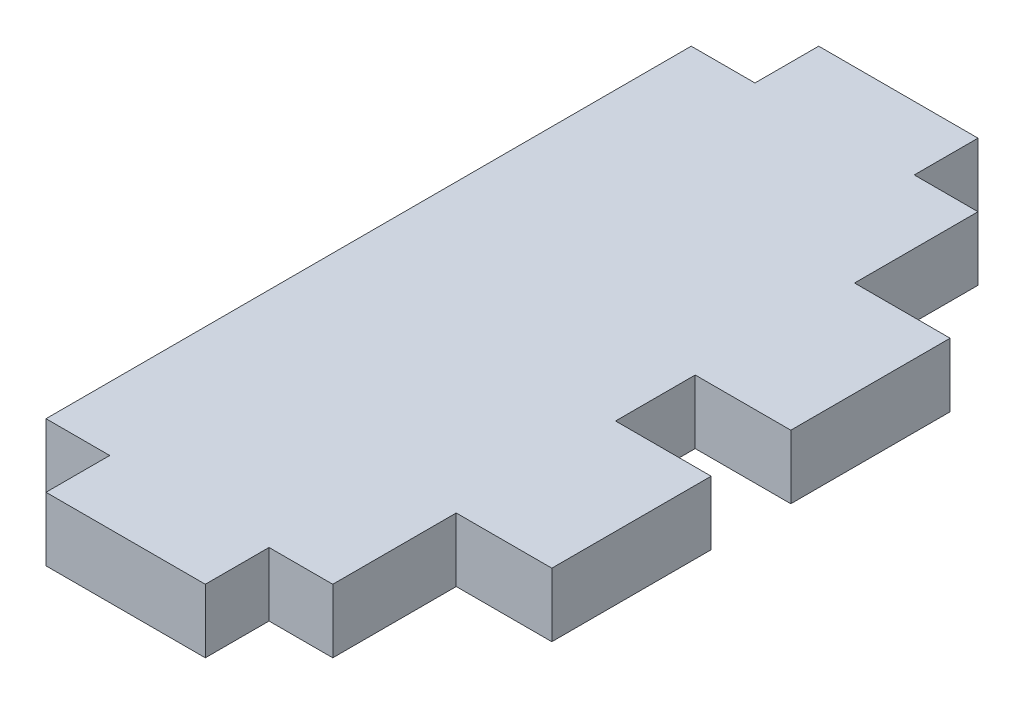
ISO-10303-21;
HEADER;
FILE_DESCRIPTION(('STEP AP214'),'2;1');
FILE_NAME('part.step','',(''),(''),'','','');
FILE_SCHEMA(('AUTOMOTIVE_DESIGN { 1 0 10303 214 1 1 1 1 }'));
ENDSEC;
DATA;
#1=APPLICATION_CONTEXT('core data for automotive mechanical design processes');
#2=APPLICATION_PROTOCOL_DEFINITION('international standard','automotive_design',2000,#1);
#3=PRODUCT_CONTEXT('',#1,'mechanical');
#4=PRODUCT('Part','Part','',(#3));
#5=PRODUCT_RELATED_PRODUCT_CATEGORY('part','',(#4));
#6=PRODUCT_DEFINITION_FORMATION('','',#4);
#7=PRODUCT_DEFINITION_CONTEXT('part definition',#1,'design');
#8=PRODUCT_DEFINITION('design','',#6,#7);
#9=PRODUCT_DEFINITION_SHAPE('','',#8);
#10=(LENGTH_UNIT() NAMED_UNIT(*) SI_UNIT(.MILLI.,.METRE.));
#11=(NAMED_UNIT(*) PLANE_ANGLE_UNIT() SI_UNIT($,.RADIAN.));
#12=(NAMED_UNIT(*) SI_UNIT($,.STERADIAN.) SOLID_ANGLE_UNIT());
#13=UNCERTAINTY_MEASURE_WITH_UNIT(LENGTH_MEASURE(1.E-05),#10,'distance_accuracy_value','');
#14=(GEOMETRIC_REPRESENTATION_CONTEXT(3) GLOBAL_UNCERTAINTY_ASSIGNED_CONTEXT((#13)) GLOBAL_UNIT_ASSIGNED_CONTEXT((#10,
#11,#12)) REPRESENTATION_CONTEXT('',''));
#15=CARTESIAN_POINT('',(0.,0.,0.));
#16=DIRECTION('',(0.,0.,1.));
#17=DIRECTION('',(1.,0.,0.));
#18=AXIS2_PLACEMENT_3D('',#15,#16,#17);
#19=CARTESIAN_POINT('',(18.,4.,0.));
#20=DIRECTION('',(-1.,0.,0.));
#21=DIRECTION('',(0.,0.,1.));
#22=AXIS2_PLACEMENT_3D('',#19,#20,#21);
#23=PLANE('',#22);
#24=DIRECTION('',(0.,1.,0.));
#25=VECTOR('',#24,1.);
#26=CARTESIAN_POINT('',(18.,4.,22.75));
#27=LINE('',#26,#25);
#28=CARTESIAN_POINT('',(18.,0.,22.75));
#29=VERTEX_POINT('',#28);
#30=CARTESIAN_POINT('',(18.,4.,22.75));
#31=VERTEX_POINT('',#30);
#32=EDGE_CURVE('E194',#29,#31,#27,.T.);
#33=ORIENTED_EDGE('',*,*,#32,.F.);
#34=DIRECTION('',(0.,0.,-1.));
#35=VECTOR('',#34,1.);
#36=CARTESIAN_POINT('',(18.,0.,0.));
#37=LINE('',#36,#35);
#38=CARTESIAN_POINT('',(18.,0.,17.75));
#39=VERTEX_POINT('',#38);
#40=EDGE_CURVE('E305',#29,#39,#37,.T.);
#41=ORIENTED_EDGE('',*,*,#40,.T.);
#42=DIRECTION('',(0.,-1.,0.));
#43=VECTOR('',#42,1.);
#44=CARTESIAN_POINT('',(18.,0.,17.75));
#45=LINE('',#44,#43);
#46=CARTESIAN_POINT('',(18.,4.,17.75));
#47=VERTEX_POINT('',#46);
#48=EDGE_CURVE('E195',#47,#39,#45,.T.);
#49=ORIENTED_EDGE('',*,*,#48,.F.);
#50=DIRECTION('',(0.,0.,-1.));
#51=VECTOR('',#50,1.);
#52=CARTESIAN_POINT('',(18.,4.,0.));
#53=LINE('',#52,#51);
#54=EDGE_CURVE('E48',#31,#47,#53,.T.);
#55=ORIENTED_EDGE('',*,*,#54,.F.);
#56=EDGE_LOOP('',(#33,#41,#49,#55));
#57=FACE_BOUND('',#56,.T.);
#58=ADVANCED_FACE('F33',(#57),#23,.F.);
#59=DIRECTION('',(0.,-1.,0.));
#60=VECTOR('',#59,1.);
#61=CARTESIAN_POINT('',(18.,4.,32.75));
#62=LINE('',#61,#60);
#63=CARTESIAN_POINT('',(18.,4.,32.75));
#64=VERTEX_POINT('',#63);
#65=CARTESIAN_POINT('',(18.,0.,32.75));
#66=VERTEX_POINT('',#65);
#67=EDGE_CURVE('E56',#64,#66,#62,.T.);
#68=ORIENTED_EDGE('',*,*,#67,.F.);
#69=CARTESIAN_POINT('',(18.,4.,40.5));
#70=VERTEX_POINT('',#69);
#71=EDGE_CURVE('E288',#70,#64,#53,.T.);
#72=ORIENTED_EDGE('',*,*,#71,.F.);
#73=DIRECTION('',(0.,-1.,0.));
#74=VECTOR('',#73,1.);
#75=CARTESIAN_POINT('',(18.,4.,40.5));
#76=LINE('',#75,#74);
#77=CARTESIAN_POINT('',(18.,0.,40.5));
#78=VERTEX_POINT('',#77);
#79=EDGE_CURVE('E41',#70,#78,#76,.T.);
#80=ORIENTED_EDGE('',*,*,#79,.T.);
#81=EDGE_CURVE('E302',#78,#66,#37,.T.);
#82=ORIENTED_EDGE('',*,*,#81,.T.);
#83=EDGE_LOOP('',(#68,#72,#80,#82));
#84=FACE_BOUND('',#83,.T.);
#85=ADVANCED_FACE('F315',(#84),#23,.F.);
#86=DIRECTION('',(0.,1.,0.));
#87=VECTOR('',#86,1.);
#88=CARTESIAN_POINT('',(18.,0.,7.75000000000002));
#89=LINE('',#88,#87);
#90=CARTESIAN_POINT('',(18.,0.,7.75000000000002));
#91=VERTEX_POINT('',#90);
#92=CARTESIAN_POINT('',(18.,4.,7.75000000000002));
#93=VERTEX_POINT('',#92);
#94=EDGE_CURVE('E198',#91,#93,#89,.T.);
#95=ORIENTED_EDGE('',*,*,#94,.F.);
#96=CARTESIAN_POINT('',(18.,0.,0.));
#97=VERTEX_POINT('',#96);
#98=EDGE_CURVE('E301',#91,#97,#37,.T.);
#99=ORIENTED_EDGE('',*,*,#98,.T.);
#100=DIRECTION('',(0.,-1.,0.));
#101=VECTOR('',#100,1.);
#102=CARTESIAN_POINT('',(18.,4.,0.));
#103=LINE('',#102,#101);
#104=CARTESIAN_POINT('',(18.,4.,0.));
#105=VERTEX_POINT('',#104);
#106=EDGE_CURVE('E310',#105,#97,#103,.T.);
#107=ORIENTED_EDGE('',*,*,#106,.F.);
#108=EDGE_CURVE('E287',#93,#105,#53,.T.);
#109=ORIENTED_EDGE('',*,*,#108,.F.);
#110=EDGE_LOOP('',(#95,#99,#107,#109));
#111=FACE_BOUND('',#110,.T.);
#112=ADVANCED_FACE('F343',(#111),#23,.F.);
#113=CARTESIAN_POINT('',(0.,4.,40.5));
#114=DIRECTION('',(0.,0.,-1.));
#115=DIRECTION('',(-1.,0.,0.));
#116=AXIS2_PLACEMENT_3D('',#113,#114,#115);
#117=PLANE('',#116);
#118=DIRECTION('',(0.,-1.,0.));
#119=VECTOR('',#118,1.);
#120=CARTESIAN_POINT('',(4.,4.,40.5));
#121=LINE('',#120,#119);
#122=CARTESIAN_POINT('',(4.,4.,40.5));
#123=VERTEX_POINT('',#122);
#124=CARTESIAN_POINT('',(4.,0.,40.5));
#125=VERTEX_POINT('',#124);
#126=EDGE_CURVE('E249',#123,#125,#121,.T.);
#127=ORIENTED_EDGE('',*,*,#126,.F.);
#128=DIRECTION('',(1.,0.,0.));
#129=VECTOR('',#128,1.);
#130=CARTESIAN_POINT('',(0.,4.,40.5));
#131=LINE('',#130,#129);
#132=CARTESIAN_POINT('',(0.,4.,40.5));
#133=VERTEX_POINT('',#132);
#134=EDGE_CURVE('E284',#133,#123,#131,.T.);
#135=ORIENTED_EDGE('',*,*,#134,.F.);
#136=DIRECTION('',(0.,-1.,0.));
#137=VECTOR('',#136,1.);
#138=CARTESIAN_POINT('',(0.,4.,40.5));
#139=LINE('',#138,#137);
#140=CARTESIAN_POINT('',(0.,0.,40.5));
#141=VERTEX_POINT('',#140);
#142=EDGE_CURVE('E11',#133,#141,#139,.T.);
#143=ORIENTED_EDGE('',*,*,#142,.T.);
#144=DIRECTION('',(1.,0.,0.));
#145=VECTOR('',#144,1.);
#146=CARTESIAN_POINT('',(0.,0.,40.5));
#147=LINE('',#146,#145);
#148=EDGE_CURVE('E298',#141,#125,#147,.T.);
#149=ORIENTED_EDGE('',*,*,#148,.T.);
#150=EDGE_LOOP('',(#127,#135,#143,#149));
#151=FACE_BOUND('',#150,.T.);
#152=ADVANCED_FACE('F349',(#151),#117,.F.);
#153=CARTESIAN_POINT('',(0.,4.,0.));
#154=DIRECTION('',(0.,0.,1.));
#155=DIRECTION('',(1.,0.,0.));
#156=AXIS2_PLACEMENT_3D('',#153,#154,#155);
#157=PLANE('',#156);
#158=DIRECTION('',(0.,-1.,0.));
#159=VECTOR('',#158,1.);
#160=CARTESIAN_POINT('',(14.,4.,0.));
#161=LINE('',#160,#159);
#162=CARTESIAN_POINT('',(14.,4.,0.));
#163=VERTEX_POINT('',#162);
#164=CARTESIAN_POINT('',(14.,0.,0.));
#165=VERTEX_POINT('',#164);
#166=EDGE_CURVE('E263',#163,#165,#161,.T.);
#167=ORIENTED_EDGE('',*,*,#166,.F.);
#168=DIRECTION('',(-1.,0.,0.));
#169=VECTOR('',#168,1.);
#170=CARTESIAN_POINT('',(0.,4.,0.));
#171=LINE('',#170,#169);
#172=EDGE_CURVE('E291',#105,#163,#171,.T.);
#173=ORIENTED_EDGE('',*,*,#172,.F.);
#174=ORIENTED_EDGE('',*,*,#106,.T.);
#175=DIRECTION('',(-1.,0.,0.));
#176=VECTOR('',#175,1.);
#177=CARTESIAN_POINT('',(0.,0.,0.));
#178=LINE('',#177,#176);
#179=EDGE_CURVE('E283',#97,#165,#178,.T.);
#180=ORIENTED_EDGE('',*,*,#179,.T.);
#181=EDGE_LOOP('',(#167,#173,#174,#180));
#182=FACE_BOUND('',#181,.T.);
#183=ADVANCED_FACE('F354',(#182),#157,.F.);
#184=CARTESIAN_POINT('',(0.,4.,0.));
#185=DIRECTION('',(1.,0.,0.));
#186=DIRECTION('',(0.,0.,-1.));
#187=AXIS2_PLACEMENT_3D('',#184,#185,#186);
#188=PLANE('',#187);
#189=DIRECTION('',(0.,0.,1.));
#190=VECTOR('',#189,1.);
#191=CARTESIAN_POINT('',(0.,0.,0.));
#192=LINE('',#191,#190);
#193=CARTESIAN_POINT('',(0.,0.,0.));
#194=VERTEX_POINT('',#193);
#195=EDGE_CURVE('E273',#194,#141,#192,.T.);
#196=ORIENTED_EDGE('',*,*,#195,.T.);
#197=ORIENTED_EDGE('',*,*,#142,.F.);
#198=DIRECTION('',(0.,0.,1.));
#199=VECTOR('',#198,1.);
#200=CARTESIAN_POINT('',(0.,4.,0.));
#201=LINE('',#200,#199);
#202=CARTESIAN_POINT('',(0.,4.,0.));
#203=VERTEX_POINT('',#202);
#204=EDGE_CURVE('E280',#203,#133,#201,.T.);
#205=ORIENTED_EDGE('',*,*,#204,.F.);
#206=DIRECTION('',(0.,-1.,0.));
#207=VECTOR('',#206,1.);
#208=CARTESIAN_POINT('',(0.,4.,0.));
#209=LINE('',#208,#207);
#210=EDGE_CURVE('E294',#203,#194,#209,.T.);
#211=ORIENTED_EDGE('',*,*,#210,.T.);
#212=EDGE_LOOP('',(#196,#197,#205,#211));
#213=FACE_BOUND('',#212,.T.);
#214=ADVANCED_FACE('F35',(#213),#188,.F.);
#215=CARTESIAN_POINT('',(14.,4.,40.5));
#216=VERTEX_POINT('',#215);
#217=EDGE_CURVE('E282',#216,#70,#131,.T.);
#218=ORIENTED_EDGE('',*,*,#217,.F.);
#219=DIRECTION('',(0.,-1.,0.));
#220=VECTOR('',#219,1.);
#221=CARTESIAN_POINT('',(14.,4.,40.5));
#222=LINE('',#221,#220);
#223=CARTESIAN_POINT('',(14.,0.,40.5));
#224=VERTEX_POINT('',#223);
#225=EDGE_CURVE('E245',#216,#224,#222,.T.);
#226=ORIENTED_EDGE('',*,*,#225,.T.);
#227=EDGE_CURVE('E297',#224,#78,#147,.T.);
#228=ORIENTED_EDGE('',*,*,#227,.T.);
#229=ORIENTED_EDGE('',*,*,#79,.F.);
#230=EDGE_LOOP('',(#218,#226,#228,#229));
#231=FACE_BOUND('',#230,.T.);
#232=ADVANCED_FACE('F356',(#231),#117,.F.);
#233=CARTESIAN_POINT('',(4.,4.,0.));
#234=VERTEX_POINT('',#233);
#235=EDGE_CURVE('E290',#234,#203,#171,.T.);
#236=ORIENTED_EDGE('',*,*,#235,.F.);
#237=DIRECTION('',(0.,-1.,0.));
#238=VECTOR('',#237,1.);
#239=CARTESIAN_POINT('',(4.,4.,0.));
#240=LINE('',#239,#238);
#241=CARTESIAN_POINT('',(4.,0.,0.));
#242=VERTEX_POINT('',#241);
#243=EDGE_CURVE('E276',#234,#242,#240,.T.);
#244=ORIENTED_EDGE('',*,*,#243,.T.);
#245=EDGE_CURVE('E304',#242,#194,#178,.T.);
#246=ORIENTED_EDGE('',*,*,#245,.T.);
#247=ORIENTED_EDGE('',*,*,#210,.F.);
#248=EDGE_LOOP('',(#236,#244,#246,#247));
#249=FACE_BOUND('',#248,.T.);
#250=ADVANCED_FACE('F389',(#249),#157,.F.);
#251=CARTESIAN_POINT('',(0.,4.,0.));
#252=DIRECTION('',(0.,1.,0.));
#253=DIRECTION('',(0.,0.,1.));
#254=AXIS2_PLACEMENT_3D('',#251,#252,#253);
#255=PLANE('',#254);
#256=ORIENTED_EDGE('',*,*,#204,.T.);
#257=ORIENTED_EDGE('',*,*,#134,.T.);
#258=DIRECTION('',(0.,0.,-1.));
#259=VECTOR('',#258,1.);
#260=CARTESIAN_POINT('',(4.,4.,40.5));
#261=LINE('',#260,#259);
#262=CARTESIAN_POINT('',(4.,4.,44.5));
#263=VERTEX_POINT('',#262);
#264=EDGE_CURVE('E235',#263,#123,#261,.T.);
#265=ORIENTED_EDGE('',*,*,#264,.F.);
#266=DIRECTION('',(-1.,0.,0.));
#267=VECTOR('',#266,1.);
#268=CARTESIAN_POINT('',(14.,4.,44.5));
#269=LINE('',#268,#267);
#270=CARTESIAN_POINT('',(14.,4.,44.5));
#271=VERTEX_POINT('',#270);
#272=EDGE_CURVE('E231',#271,#263,#269,.T.);
#273=ORIENTED_EDGE('',*,*,#272,.F.);
#274=DIRECTION('',(0.,0.,1.));
#275=VECTOR('',#274,1.);
#276=CARTESIAN_POINT('',(14.,4.,40.5));
#277=LINE('',#276,#275);
#278=EDGE_CURVE('E228',#216,#271,#277,.T.);
#279=ORIENTED_EDGE('',*,*,#278,.F.);
#280=ORIENTED_EDGE('',*,*,#217,.T.);
#281=ORIENTED_EDGE('',*,*,#71,.T.);
#282=DIRECTION('',(-1.,0.,0.));
#283=VECTOR('',#282,1.);
#284=CARTESIAN_POINT('',(24.,4.,32.75));
#285=LINE('',#284,#283);
#286=CARTESIAN_POINT('',(24.,4.,32.75));
#287=VERTEX_POINT('',#286);
#288=EDGE_CURVE('E179',#287,#64,#285,.T.);
#289=ORIENTED_EDGE('',*,*,#288,.F.);
#290=DIRECTION('',(0.,0.,1.));
#291=VECTOR('',#290,1.);
#292=CARTESIAN_POINT('',(24.,4.,22.75));
#293=LINE('',#292,#291);
#294=CARTESIAN_POINT('',(24.,4.,22.75));
#295=VERTEX_POINT('',#294);
#296=EDGE_CURVE('E171',#295,#287,#293,.T.);
#297=ORIENTED_EDGE('',*,*,#296,.F.);
#298=DIRECTION('',(-1.,0.,0.));
#299=VECTOR('',#298,1.);
#300=CARTESIAN_POINT('',(24.,4.,22.75));
#301=LINE('',#300,#299);
#302=EDGE_CURVE('E176',#295,#31,#301,.T.);
#303=ORIENTED_EDGE('',*,*,#302,.T.);
#304=ORIENTED_EDGE('',*,*,#54,.T.);
#305=DIRECTION('',(-1.,0.,0.));
#306=VECTOR('',#305,1.);
#307=CARTESIAN_POINT('',(24.,4.,17.75));
#308=LINE('',#307,#306);
#309=CARTESIAN_POINT('',(24.,4.,17.75));
#310=VERTEX_POINT('',#309);
#311=EDGE_CURVE('E212',#310,#47,#308,.T.);
#312=ORIENTED_EDGE('',*,*,#311,.F.);
#313=DIRECTION('',(0.,0.,1.));
#314=VECTOR('',#313,1.);
#315=CARTESIAN_POINT('',(24.,4.,17.75));
#316=LINE('',#315,#314);
#317=CARTESIAN_POINT('',(24.,4.,7.75000000000002));
#318=VERTEX_POINT('',#317);
#319=EDGE_CURVE('E211',#318,#310,#316,.T.);
#320=ORIENTED_EDGE('',*,*,#319,.F.);
#321=DIRECTION('',(-1.,0.,0.));
#322=VECTOR('',#321,1.);
#323=CARTESIAN_POINT('',(24.,4.,7.75000000000002));
#324=LINE('',#323,#322);
#325=EDGE_CURVE('E218',#318,#93,#324,.T.);
#326=ORIENTED_EDGE('',*,*,#325,.T.);
#327=ORIENTED_EDGE('',*,*,#108,.T.);
#328=ORIENTED_EDGE('',*,*,#172,.T.);
#329=DIRECTION('',(0.,0.,1.));
#330=VECTOR('',#329,1.);
#331=CARTESIAN_POINT('',(14.,4.,0.));
#332=LINE('',#331,#330);
#333=CARTESIAN_POINT('',(14.,4.,-4.));
#334=VERTEX_POINT('',#333);
#335=EDGE_CURVE('E254',#334,#163,#332,.T.);
#336=ORIENTED_EDGE('',*,*,#335,.F.);
#337=DIRECTION('',(1.,0.,0.));
#338=VECTOR('',#337,1.);
#339=CARTESIAN_POINT('',(14.,4.,-4.));
#340=LINE('',#339,#338);
#341=CARTESIAN_POINT('',(4.,4.,-4.));
#342=VERTEX_POINT('',#341);
#343=EDGE_CURVE('E260',#342,#334,#340,.T.);
#344=ORIENTED_EDGE('',*,*,#343,.F.);
#345=DIRECTION('',(0.,0.,-1.));
#346=VECTOR('',#345,1.);
#347=CARTESIAN_POINT('',(4.,4.,0.));
#348=LINE('',#347,#346);
#349=EDGE_CURVE('E256',#234,#342,#348,.T.);
#350=ORIENTED_EDGE('',*,*,#349,.F.);
#351=ORIENTED_EDGE('',*,*,#235,.T.);
#352=EDGE_LOOP('',(#256,#257,#265,#273,#279,#280,#281,#289,#297,#303,#304,#312,#320,#326,#327,
#328,#336,#344,#350,#351));
#353=FACE_BOUND('',#352,.T.);
#354=ADVANCED_FACE('F174',(#353),#255,.T.);
#355=CARTESIAN_POINT('',(0.,0.,0.));
#356=DIRECTION('',(0.,1.,0.));
#357=DIRECTION('',(0.,0.,1.));
#358=AXIS2_PLACEMENT_3D('',#355,#356,#357);
#359=PLANE('',#358);
#360=ORIENTED_EDGE('',*,*,#195,.F.);
#361=ORIENTED_EDGE('',*,*,#245,.F.);
#362=DIRECTION('',(0.,0.,-1.));
#363=VECTOR('',#362,1.);
#364=CARTESIAN_POINT('',(4.,0.,0.));
#365=LINE('',#364,#363);
#366=CARTESIAN_POINT('',(4.,0.,-4.));
#367=VERTEX_POINT('',#366);
#368=EDGE_CURVE('E266',#242,#367,#365,.T.);
#369=ORIENTED_EDGE('',*,*,#368,.T.);
#370=DIRECTION('',(1.,0.,0.));
#371=VECTOR('',#370,1.);
#372=CARTESIAN_POINT('',(14.,0.,-4.));
#373=LINE('',#372,#371);
#374=CARTESIAN_POINT('',(14.,0.,-4.));
#375=VERTEX_POINT('',#374);
#376=EDGE_CURVE('E257',#367,#375,#373,.T.);
#377=ORIENTED_EDGE('',*,*,#376,.T.);
#378=DIRECTION('',(0.,0.,1.));
#379=VECTOR('',#378,1.);
#380=CARTESIAN_POINT('',(14.,0.,0.));
#381=LINE('',#380,#379);
#382=EDGE_CURVE('E248',#375,#165,#381,.T.);
#383=ORIENTED_EDGE('',*,*,#382,.T.);
#384=ORIENTED_EDGE('',*,*,#179,.F.);
#385=ORIENTED_EDGE('',*,*,#98,.F.);
#386=DIRECTION('',(-1.,0.,0.));
#387=VECTOR('',#386,1.);
#388=CARTESIAN_POINT('',(24.,0.,7.75000000000002));
#389=LINE('',#388,#387);
#390=CARTESIAN_POINT('',(24.,0.,7.75000000000002));
#391=VERTEX_POINT('',#390);
#392=EDGE_CURVE('E221',#391,#91,#389,.T.);
#393=ORIENTED_EDGE('',*,*,#392,.F.);
#394=DIRECTION('',(0.,0.,-1.));
#395=VECTOR('',#394,1.);
#396=CARTESIAN_POINT('',(24.,0.,17.75));
#397=LINE('',#396,#395);
#398=CARTESIAN_POINT('',(24.,0.,17.75));
#399=VERTEX_POINT('',#398);
#400=EDGE_CURVE('E207',#399,#391,#397,.T.);
#401=ORIENTED_EDGE('',*,*,#400,.F.);
#402=DIRECTION('',(-1.,0.,0.));
#403=VECTOR('',#402,1.);
#404=CARTESIAN_POINT('',(24.,0.,17.75));
#405=LINE('',#404,#403);
#406=EDGE_CURVE('E224',#399,#39,#405,.T.);
#407=ORIENTED_EDGE('',*,*,#406,.T.);
#408=ORIENTED_EDGE('',*,*,#40,.F.);
#409=DIRECTION('',(-1.,0.,0.));
#410=VECTOR('',#409,1.);
#411=CARTESIAN_POINT('',(24.,0.,22.75));
#412=LINE('',#411,#410);
#413=CARTESIAN_POINT('',(24.,0.,22.75));
#414=VERTEX_POINT('',#413);
#415=EDGE_CURVE('E325',#414,#29,#412,.T.);
#416=ORIENTED_EDGE('',*,*,#415,.F.);
#417=DIRECTION('',(0.,0.,-1.));
#418=VECTOR('',#417,1.);
#419=CARTESIAN_POINT('',(24.,0.,22.75));
#420=LINE('',#419,#418);
#421=CARTESIAN_POINT('',(24.,0.,32.75));
#422=VERTEX_POINT('',#421);
#423=EDGE_CURVE('E188',#422,#414,#420,.T.);
#424=ORIENTED_EDGE('',*,*,#423,.F.);
#425=DIRECTION('',(-1.,0.,0.));
#426=VECTOR('',#425,1.);
#427=CARTESIAN_POINT('',(24.,0.,32.75));
#428=LINE('',#427,#426);
#429=EDGE_CURVE('E200',#422,#66,#428,.T.);
#430=ORIENTED_EDGE('',*,*,#429,.T.);
#431=ORIENTED_EDGE('',*,*,#81,.F.);
#432=ORIENTED_EDGE('',*,*,#227,.F.);
#433=DIRECTION('',(0.,0.,1.));
#434=VECTOR('',#433,1.);
#435=CARTESIAN_POINT('',(14.,0.,40.5));
#436=LINE('',#435,#434);
#437=CARTESIAN_POINT('',(14.,0.,44.5));
#438=VERTEX_POINT('',#437);
#439=EDGE_CURVE('E227',#224,#438,#436,.T.);
#440=ORIENTED_EDGE('',*,*,#439,.T.);
#441=DIRECTION('',(-1.,0.,0.));
#442=VECTOR('',#441,1.);
#443=CARTESIAN_POINT('',(14.,0.,44.5));
#444=LINE('',#443,#442);
#445=CARTESIAN_POINT('',(4.,0.,44.5));
#446=VERTEX_POINT('',#445);
#447=EDGE_CURVE('E240',#438,#446,#444,.T.);
#448=ORIENTED_EDGE('',*,*,#447,.T.);
#449=DIRECTION('',(0.,0.,-1.));
#450=VECTOR('',#449,1.);
#451=CARTESIAN_POINT('',(4.,0.,40.5));
#452=LINE('',#451,#450);
#453=EDGE_CURVE('E232',#446,#125,#452,.T.);
#454=ORIENTED_EDGE('',*,*,#453,.T.);
#455=ORIENTED_EDGE('',*,*,#148,.F.);
#456=EDGE_LOOP('',(#360,#361,#369,#377,#383,#384,#385,#393,#401,#407,#408,#416,#424,#430,#431,
#432,#440,#448,#454,#455));
#457=FACE_BOUND('',#456,.T.);
#458=ADVANCED_FACE('F322',(#457),#359,.F.);
#459=CARTESIAN_POINT('',(14.,4.,0.));
#460=DIRECTION('',(1.,0.,0.));
#461=DIRECTION('',(0.,0.,-1.));
#462=AXIS2_PLACEMENT_3D('',#459,#460,#461);
#463=PLANE('',#462);
#464=ORIENTED_EDGE('',*,*,#382,.F.);
#465=DIRECTION('',(0.,-1.,0.));
#466=VECTOR('',#465,1.);
#467=CARTESIAN_POINT('',(14.,4.,-4.));
#468=LINE('',#467,#466);
#469=EDGE_CURVE('E271',#334,#375,#468,.T.);
#470=ORIENTED_EDGE('',*,*,#469,.F.);
#471=ORIENTED_EDGE('',*,*,#335,.T.);
#472=ORIENTED_EDGE('',*,*,#166,.T.);
#473=EDGE_LOOP('',(#464,#470,#471,#472));
#474=FACE_BOUND('',#473,.T.);
#475=ADVANCED_FACE('F378',(#474),#463,.T.);
#476=CARTESIAN_POINT('',(14.,4.,-4.));
#477=DIRECTION('',(0.,0.,-1.));
#478=DIRECTION('',(-1.,0.,0.));
#479=AXIS2_PLACEMENT_3D('',#476,#477,#478);
#480=PLANE('',#479);
#481=ORIENTED_EDGE('',*,*,#376,.F.);
#482=DIRECTION('',(0.,-1.,0.));
#483=VECTOR('',#482,1.);
#484=CARTESIAN_POINT('',(4.,4.,-4.));
#485=LINE('',#484,#483);
#486=EDGE_CURVE('E274',#342,#367,#485,.T.);
#487=ORIENTED_EDGE('',*,*,#486,.F.);
#488=ORIENTED_EDGE('',*,*,#343,.T.);
#489=ORIENTED_EDGE('',*,*,#469,.T.);
#490=EDGE_LOOP('',(#481,#487,#488,#489));
#491=FACE_BOUND('',#490,.T.);
#492=ADVANCED_FACE('F382',(#491),#480,.T.);
#493=CARTESIAN_POINT('',(4.,4.,0.));
#494=DIRECTION('',(-1.,0.,0.));
#495=DIRECTION('',(0.,0.,1.));
#496=AXIS2_PLACEMENT_3D('',#493,#494,#495);
#497=PLANE('',#496);
#498=ORIENTED_EDGE('',*,*,#368,.F.);
#499=ORIENTED_EDGE('',*,*,#243,.F.);
#500=ORIENTED_EDGE('',*,*,#349,.T.);
#501=ORIENTED_EDGE('',*,*,#486,.T.);
#502=EDGE_LOOP('',(#498,#499,#500,#501));
#503=FACE_BOUND('',#502,.T.);
#504=ADVANCED_FACE('F422',(#503),#497,.T.);
#505=CARTESIAN_POINT('',(14.,4.,40.5));
#506=DIRECTION('',(1.,0.,0.));
#507=DIRECTION('',(0.,0.,-1.));
#508=AXIS2_PLACEMENT_3D('',#505,#506,#507);
#509=PLANE('',#508);
#510=ORIENTED_EDGE('',*,*,#439,.F.);
#511=ORIENTED_EDGE('',*,*,#225,.F.);
#512=ORIENTED_EDGE('',*,*,#278,.T.);
#513=DIRECTION('',(0.,-1.,0.));
#514=VECTOR('',#513,1.);
#515=CARTESIAN_POINT('',(14.,4.,44.5));
#516=LINE('',#515,#514);
#517=EDGE_CURVE('E237',#271,#438,#516,.T.);
#518=ORIENTED_EDGE('',*,*,#517,.T.);
#519=EDGE_LOOP('',(#510,#511,#512,#518));
#520=FACE_BOUND('',#519,.T.);
#521=ADVANCED_FACE('F404',(#520),#509,.T.);
#522=CARTESIAN_POINT('',(4.,4.,40.5));
#523=DIRECTION('',(-1.,0.,0.));
#524=DIRECTION('',(0.,0.,1.));
#525=AXIS2_PLACEMENT_3D('',#522,#523,#524);
#526=PLANE('',#525);
#527=ORIENTED_EDGE('',*,*,#453,.F.);
#528=DIRECTION('',(0.,-1.,0.));
#529=VECTOR('',#528,1.);
#530=CARTESIAN_POINT('',(4.,4.,44.5));
#531=LINE('',#530,#529);
#532=EDGE_CURVE('E251',#263,#446,#531,.T.);
#533=ORIENTED_EDGE('',*,*,#532,.F.);
#534=ORIENTED_EDGE('',*,*,#264,.T.);
#535=ORIENTED_EDGE('',*,*,#126,.T.);
#536=EDGE_LOOP('',(#527,#533,#534,#535));
#537=FACE_BOUND('',#536,.T.);
#538=ADVANCED_FACE('F398',(#537),#526,.T.);
#539=CARTESIAN_POINT('',(14.,4.,44.5));
#540=DIRECTION('',(0.,0.,1.));
#541=DIRECTION('',(1.,0.,0.));
#542=AXIS2_PLACEMENT_3D('',#539,#540,#541);
#543=PLANE('',#542);
#544=ORIENTED_EDGE('',*,*,#447,.F.);
#545=ORIENTED_EDGE('',*,*,#517,.F.);
#546=ORIENTED_EDGE('',*,*,#272,.T.);
#547=ORIENTED_EDGE('',*,*,#532,.T.);
#548=EDGE_LOOP('',(#544,#545,#546,#547));
#549=FACE_BOUND('',#548,.T.);
#550=ADVANCED_FACE('F401',(#549),#543,.T.);
#551=CARTESIAN_POINT('',(24.,0.,17.75));
#552=DIRECTION('',(0.,0.,-1.));
#553=DIRECTION('',(-1.,0.,0.));
#554=AXIS2_PLACEMENT_3D('',#551,#552,#553);
#555=PLANE('',#554);
#556=ORIENTED_EDGE('',*,*,#48,.T.);
#557=ORIENTED_EDGE('',*,*,#406,.F.);
#558=DIRECTION('',(0.,-1.,0.));
#559=VECTOR('',#558,1.);
#560=CARTESIAN_POINT('',(24.,0.,17.75));
#561=LINE('',#560,#559);
#562=EDGE_CURVE('E204',#310,#399,#561,.T.);
#563=ORIENTED_EDGE('',*,*,#562,.F.);
#564=ORIENTED_EDGE('',*,*,#311,.T.);
#565=EDGE_LOOP('',(#556,#557,#563,#564));
#566=FACE_BOUND('',#565,.T.);
#567=ADVANCED_FACE('F371',(#566),#555,.F.);
#568=CARTESIAN_POINT('',(24.,0.,7.75000000000002));
#569=DIRECTION('',(0.,0.,1.));
#570=DIRECTION('',(1.,0.,0.));
#571=AXIS2_PLACEMENT_3D('',#568,#569,#570);
#572=PLANE('',#571);
#573=ORIENTED_EDGE('',*,*,#94,.T.);
#574=ORIENTED_EDGE('',*,*,#325,.F.);
#575=DIRECTION('',(0.,1.,0.));
#576=VECTOR('',#575,1.);
#577=CARTESIAN_POINT('',(24.,0.,7.75000000000002));
#578=LINE('',#577,#576);
#579=EDGE_CURVE('E209',#391,#318,#578,.T.);
#580=ORIENTED_EDGE('',*,*,#579,.F.);
#581=ORIENTED_EDGE('',*,*,#392,.T.);
#582=EDGE_LOOP('',(#573,#574,#580,#581));
#583=FACE_BOUND('',#582,.T.);
#584=ADVANCED_FACE('F364',(#583),#572,.F.);
#585=CARTESIAN_POINT('',(24.,0.,0.));
#586=DIRECTION('',(-1.,0.,0.));
#587=DIRECTION('',(0.,0.,1.));
#588=AXIS2_PLACEMENT_3D('',#585,#586,#587);
#589=PLANE('',#588);
#590=ORIENTED_EDGE('',*,*,#562,.T.);
#591=ORIENTED_EDGE('',*,*,#400,.T.);
#592=ORIENTED_EDGE('',*,*,#579,.T.);
#593=ORIENTED_EDGE('',*,*,#319,.T.);
#594=EDGE_LOOP('',(#590,#591,#592,#593));
#595=FACE_BOUND('',#594,.T.);
#596=ADVANCED_FACE('F339',(#595),#589,.F.);
#597=CARTESIAN_POINT('',(24.,4.,22.75));
#598=DIRECTION('',(0.,0.,1.));
#599=DIRECTION('',(1.,0.,0.));
#600=AXIS2_PLACEMENT_3D('',#597,#598,#599);
#601=PLANE('',#600);
#602=ORIENTED_EDGE('',*,*,#32,.T.);
#603=ORIENTED_EDGE('',*,*,#302,.F.);
#604=DIRECTION('',(0.,1.,0.));
#605=VECTOR('',#604,1.);
#606=CARTESIAN_POINT('',(24.,4.,22.75));
#607=LINE('',#606,#605);
#608=EDGE_CURVE('E183',#414,#295,#607,.T.);
#609=ORIENTED_EDGE('',*,*,#608,.F.);
#610=ORIENTED_EDGE('',*,*,#415,.T.);
#611=EDGE_LOOP('',(#602,#603,#609,#610));
#612=FACE_BOUND('',#611,.T.);
#613=ADVANCED_FACE('F193',(#612),#601,.F.);
#614=CARTESIAN_POINT('',(24.,4.,32.75));
#615=DIRECTION('',(0.,0.,-1.));
#616=DIRECTION('',(-1.,0.,0.));
#617=AXIS2_PLACEMENT_3D('',#614,#615,#616);
#618=PLANE('',#617);
#619=ORIENTED_EDGE('',*,*,#67,.T.);
#620=ORIENTED_EDGE('',*,*,#429,.F.);
#621=DIRECTION('',(0.,-1.,0.));
#622=VECTOR('',#621,1.);
#623=CARTESIAN_POINT('',(24.,4.,32.75));
#624=LINE('',#623,#622);
#625=EDGE_CURVE('E182',#287,#422,#624,.T.);
#626=ORIENTED_EDGE('',*,*,#625,.F.);
#627=ORIENTED_EDGE('',*,*,#288,.T.);
#628=EDGE_LOOP('',(#619,#620,#626,#627));
#629=FACE_BOUND('',#628,.T.);
#630=ADVANCED_FACE('F331',(#629),#618,.F.);
#631=CARTESIAN_POINT('',(24.,0.,0.));
#632=DIRECTION('',(-1.,0.,0.));
#633=DIRECTION('',(0.,0.,1.));
#634=AXIS2_PLACEMENT_3D('',#631,#632,#633);
#635=PLANE('',#634);
#636=ORIENTED_EDGE('',*,*,#608,.T.);
#637=ORIENTED_EDGE('',*,*,#296,.T.);
#638=ORIENTED_EDGE('',*,*,#625,.T.);
#639=ORIENTED_EDGE('',*,*,#423,.T.);
#640=EDGE_LOOP('',(#636,#637,#638,#639));
#641=FACE_BOUND('',#640,.T.);
#642=ADVANCED_FACE('F186',(#641),#635,.F.);
#643=CLOSED_SHELL('',(#58,#85,#112,#152,#183,#214,#232,#250,#354,#458,#475,#492,#504,#521,#538,
#550,#567,#584,#596,#613,#630,#642));
#644=MANIFOLD_SOLID_BREP('B2',#643);
#645=ADVANCED_BREP_SHAPE_REPRESENTATION('',(#18,#644),#14);
#646=SHAPE_DEFINITION_REPRESENTATION(#9,#645);
ENDSEC;
END-ISO-10303-21;
